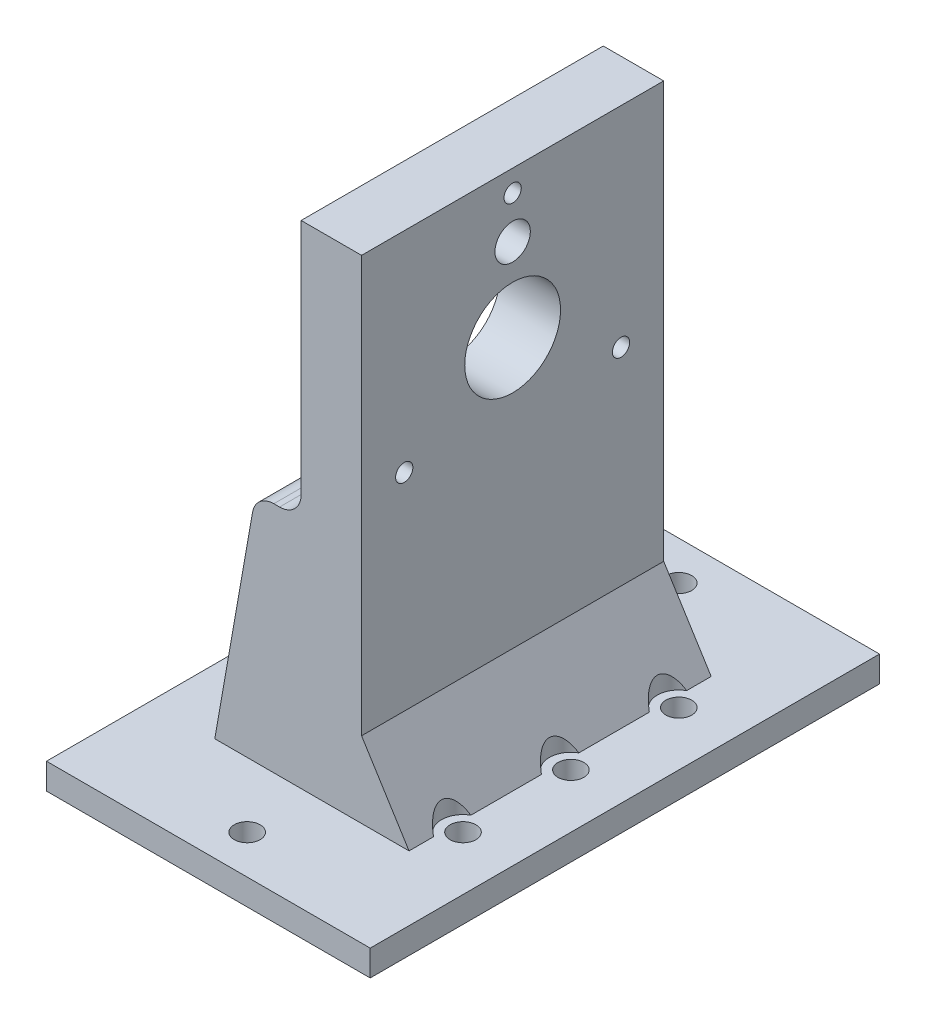
ISO-10303-21;
HEADER;
FILE_DESCRIPTION(('STEP AP214'),'2;1');
FILE_NAME('part.step','',(''),(''),'','','');
FILE_SCHEMA(('AUTOMOTIVE_DESIGN { 1 0 10303 214 1 1 1 1 }'));
ENDSEC;
DATA;
#1=APPLICATION_CONTEXT('core data for automotive mechanical design processes');
#2=APPLICATION_PROTOCOL_DEFINITION('international standard','automotive_design',2000,#1);
#3=PRODUCT_CONTEXT('',#1,'mechanical');
#4=PRODUCT('Part','Part','',(#3));
#5=PRODUCT_RELATED_PRODUCT_CATEGORY('part','',(#4));
#6=PRODUCT_DEFINITION_FORMATION('','',#4);
#7=PRODUCT_DEFINITION_CONTEXT('part definition',#1,'design');
#8=PRODUCT_DEFINITION('design','',#6,#7);
#9=PRODUCT_DEFINITION_SHAPE('','',#8);
#10=(LENGTH_UNIT() NAMED_UNIT(*) SI_UNIT(.MILLI.,.METRE.));
#11=(NAMED_UNIT(*) PLANE_ANGLE_UNIT() SI_UNIT($,.RADIAN.));
#12=(NAMED_UNIT(*) SI_UNIT($,.STERADIAN.) SOLID_ANGLE_UNIT());
#13=UNCERTAINTY_MEASURE_WITH_UNIT(LENGTH_MEASURE(1.E-05),#10,'distance_accuracy_value','');
#14=(GEOMETRIC_REPRESENTATION_CONTEXT(3) GLOBAL_UNCERTAINTY_ASSIGNED_CONTEXT((#13)) GLOBAL_UNIT_ASSIGNED_CONTEXT((#10,
#11,#12)) REPRESENTATION_CONTEXT('',''));
#15=CARTESIAN_POINT('',(0.,0.,0.));
#16=DIRECTION('',(0.,0.,1.));
#17=DIRECTION('',(1.,0.,0.));
#18=AXIS2_PLACEMENT_3D('',#15,#16,#17);
#19=CARTESIAN_POINT('',(0.,6.,0.));
#20=DIRECTION('',(0.,0.,-1.));
#21=DIRECTION('',(-1.,0.,0.));
#22=AXIS2_PLACEMENT_3D('',#19,#20,#21);
#23=PLANE('',#22);
#24=DIRECTION('',(-0.172799478008125,-0.984957024646314,0.));
#25=VECTOR('',#24,1.);
#26=CARTESIAN_POINT('',(35.,120.,0.));
#27=LINE('',#26,#25);
#28=CARTESIAN_POINT('',(23.748069717551,55.8639973900406,0.));
#29=VERTEX_POINT('',#28);
#30=CARTESIAN_POINT('',(15.,6.,0.));
#31=VERTEX_POINT('',#30);
#32=EDGE_CURVE('E378',#29,#31,#27,.T.);
#33=ORIENTED_EDGE('',*,*,#32,.F.);
#34=CARTESIAN_POINT('',(28.6728548407826,55.,0.));
#35=DIRECTION('',(0.,0.,-1.));
#36=DIRECTION('',(-1.,0.,0.));
#37=AXIS2_PLACEMENT_3D('',#34,#35,#36);
#38=CIRCLE('',#37,5.);
#39=CARTESIAN_POINT('',(28.6728548407826,60.,0.));
#40=VERTEX_POINT('',#39);
#41=EDGE_CURVE('E250',#29,#40,#38,.T.);
#42=ORIENTED_EDGE('',*,*,#41,.T.);
#43=DIRECTION('',(1.,0.,0.));
#44=VECTOR('',#43,1.);
#45=CARTESIAN_POINT('',(-21.4658933499122,60.,0.));
#46=LINE('',#45,#44);
#47=CARTESIAN_POINT('',(30.,60.,0.));
#48=VERTEX_POINT('',#47);
#49=EDGE_CURVE('E264',#40,#48,#46,.T.);
#50=ORIENTED_EDGE('',*,*,#49,.T.);
#51=CARTESIAN_POINT('',(30.,65.,0.));
#52=DIRECTION('',(0.,0.,-1.));
#53=DIRECTION('',(-1.,0.,0.));
#54=AXIS2_PLACEMENT_3D('',#51,#52,#53);
#55=CIRCLE('',#54,5.);
#56=CARTESIAN_POINT('',(35.,65.,0.));
#57=VERTEX_POINT('',#56);
#58=EDGE_CURVE('E11',#48,#57,#55,.F.);
#59=ORIENTED_EDGE('',*,*,#58,.T.);
#60=DIRECTION('',(0.,1.,0.));
#61=VECTOR('',#60,1.);
#62=CARTESIAN_POINT('',(35.,60.,0.));
#63=LINE('',#62,#61);
#64=CARTESIAN_POINT('',(35.,120.,0.));
#65=VERTEX_POINT('',#64);
#66=EDGE_CURVE('E172',#57,#65,#63,.T.);
#67=ORIENTED_EDGE('',*,*,#66,.T.);
#68=DIRECTION('',(1.,0.,0.));
#69=VECTOR('',#68,1.);
#70=CARTESIAN_POINT('',(0.,120.,0.));
#71=LINE('',#70,#69);
#72=CARTESIAN_POINT('',(49.,120.,0.));
#73=VERTEX_POINT('',#72);
#74=EDGE_CURVE('E177',#65,#73,#71,.T.);
#75=ORIENTED_EDGE('',*,*,#74,.T.);
#76=DIRECTION('',(0.,-1.,0.));
#77=VECTOR('',#76,1.);
#78=CARTESIAN_POINT('',(49.,120.,0.));
#79=LINE('',#78,#77);
#80=CARTESIAN_POINT('',(49.,23.6,0.));
#81=VERTEX_POINT('',#80);
#82=EDGE_CURVE('E206',#73,#81,#79,.T.);
#83=ORIENTED_EDGE('',*,*,#82,.T.);
#84=DIRECTION('',(-0.52999894000318,0.847998304005088,0.));
#85=VECTOR('',#84,1.);
#86=CARTESIAN_POINT('',(60.,6.,0.));
#87=LINE('',#86,#85);
#88=CARTESIAN_POINT('',(60.,6.,0.));
#89=VERTEX_POINT('',#88);
#90=EDGE_CURVE('E389',#89,#81,#87,.T.);
#91=ORIENTED_EDGE('',*,*,#90,.F.);
#92=DIRECTION('',(-1.,0.,0.));
#93=VECTOR('',#92,1.);
#94=CARTESIAN_POINT('',(75.,6.,0.));
#95=LINE('',#94,#93);
#96=EDGE_CURVE('E251',#89,#31,#95,.T.);
#97=ORIENTED_EDGE('',*,*,#96,.T.);
#98=EDGE_LOOP('',(#33,#42,#50,#59,#67,#75,#83,#91,#97));
#99=FACE_BOUND('',#98,.T.);
#100=ADVANCED_FACE('F40',(#99),#23,.T.);
#101=CARTESIAN_POINT('',(0.,6.,70.));
#102=DIRECTION('',(0.,0.,1.));
#103=DIRECTION('',(1.,0.,0.));
#104=AXIS2_PLACEMENT_3D('',#101,#102,#103);
#105=PLANE('',#104);
#106=DIRECTION('',(-1.,0.,0.));
#107=VECTOR('',#106,1.);
#108=CARTESIAN_POINT('',(35.,60.,70.));
#109=LINE('',#108,#107);
#110=CARTESIAN_POINT('',(30.,60.,70.));
#111=VERTEX_POINT('',#110);
#112=CARTESIAN_POINT('',(28.6728548407826,60.,70.));
#113=VERTEX_POINT('',#112);
#114=EDGE_CURVE('E261',#111,#113,#109,.T.);
#115=ORIENTED_EDGE('',*,*,#114,.T.);
#116=CARTESIAN_POINT('',(28.6728548407826,55.,70.));
#117=DIRECTION('',(0.,0.,1.));
#118=DIRECTION('',(1.,0.,0.));
#119=AXIS2_PLACEMENT_3D('',#116,#117,#118);
#120=CIRCLE('',#119,5.);
#121=CARTESIAN_POINT('',(23.748069717551,55.8639973900406,70.));
#122=VERTEX_POINT('',#121);
#123=EDGE_CURVE('E256',#113,#122,#120,.T.);
#124=ORIENTED_EDGE('',*,*,#123,.T.);
#125=DIRECTION('',(-0.172799478008125,-0.984957024646314,0.));
#126=VECTOR('',#125,1.);
#127=CARTESIAN_POINT('',(35.,120.,70.));
#128=LINE('',#127,#126);
#129=CARTESIAN_POINT('',(15.,6.,70.));
#130=VERTEX_POINT('',#129);
#131=EDGE_CURVE('E379',#122,#130,#128,.T.);
#132=ORIENTED_EDGE('',*,*,#131,.T.);
#133=DIRECTION('',(-1.,0.,0.));
#134=VECTOR('',#133,1.);
#135=CARTESIAN_POINT('',(75.,6.,70.));
#136=LINE('',#135,#134);
#137=CARTESIAN_POINT('',(60.,6.,70.));
#138=VERTEX_POINT('',#137);
#139=EDGE_CURVE('E226',#138,#130,#136,.T.);
#140=ORIENTED_EDGE('',*,*,#139,.F.);
#141=DIRECTION('',(-0.52999894000318,0.847998304005088,0.));
#142=VECTOR('',#141,1.);
#143=CARTESIAN_POINT('',(60.,6.,70.));
#144=LINE('',#143,#142);
#145=CARTESIAN_POINT('',(49.,23.6,70.));
#146=VERTEX_POINT('',#145);
#147=EDGE_CURVE('E386',#138,#146,#144,.T.);
#148=ORIENTED_EDGE('',*,*,#147,.T.);
#149=DIRECTION('',(0.,-1.,0.));
#150=VECTOR('',#149,1.);
#151=CARTESIAN_POINT('',(49.,120.,70.));
#152=LINE('',#151,#150);
#153=CARTESIAN_POINT('',(49.,120.,70.));
#154=VERTEX_POINT('',#153);
#155=EDGE_CURVE('E208',#154,#146,#152,.T.);
#156=ORIENTED_EDGE('',*,*,#155,.F.);
#157=DIRECTION('',(-1.,0.,0.));
#158=VECTOR('',#157,1.);
#159=CARTESIAN_POINT('',(0.,120.,70.));
#160=LINE('',#159,#158);
#161=CARTESIAN_POINT('',(35.,120.,70.));
#162=VERTEX_POINT('',#161);
#163=EDGE_CURVE('E193',#154,#162,#160,.T.);
#164=ORIENTED_EDGE('',*,*,#163,.T.);
#165=DIRECTION('',(0.,1.,0.));
#166=VECTOR('',#165,1.);
#167=CARTESIAN_POINT('',(35.,60.,70.));
#168=LINE('',#167,#166);
#169=CARTESIAN_POINT('',(35.,65.,70.));
#170=VERTEX_POINT('',#169);
#171=EDGE_CURVE('E183',#170,#162,#168,.T.);
#172=ORIENTED_EDGE('',*,*,#171,.F.);
#173=CARTESIAN_POINT('',(30.,65.,70.));
#174=DIRECTION('',(0.,0.,1.));
#175=DIRECTION('',(1.,0.,0.));
#176=AXIS2_PLACEMENT_3D('',#173,#174,#175);
#177=CIRCLE('',#176,5.);
#178=EDGE_CURVE('E48',#170,#111,#177,.F.);
#179=ORIENTED_EDGE('',*,*,#178,.T.);
#180=EDGE_LOOP('',(#115,#124,#132,#140,#148,#156,#164,#172,#179));
#181=FACE_BOUND('',#180,.T.);
#182=ADVANCED_FACE('F260',(#181),#105,.T.);
#183=CARTESIAN_POINT('',(75.,86.,35.));
#184=DIRECTION('',(-1.,0.,0.));
#185=DIRECTION('',(0.,0.,1.));
#186=AXIS2_PLACEMENT_3D('',#183,#184,#185);
#187=CYLINDRICAL_SURFACE('',#186,11.1);
#188=CARTESIAN_POINT('',(49.,86.,35.));
#189=DIRECTION('',(1.,0.,0.));
#190=DIRECTION('',(0.,0.,-1.));
#191=AXIS2_PLACEMENT_3D('',#188,#189,#190);
#192=CIRCLE('',#191,11.1);
#193=CARTESIAN_POINT('',(49.,86.,23.9));
#194=VERTEX_POINT('',#193);
#195=EDGE_CURVE('E227',#194,#194,#192,.T.);
#196=ORIENTED_EDGE('',*,*,#195,.T.);
#197=EDGE_LOOP('',(#196));
#198=FACE_BOUND('',#197,.T.);
#199=CARTESIAN_POINT('',(35.,86.,35.));
#200=DIRECTION('',(-1.,0.,0.));
#201=DIRECTION('',(0.,0.,1.));
#202=AXIS2_PLACEMENT_3D('',#199,#200,#201);
#203=CIRCLE('',#202,11.1);
#204=CARTESIAN_POINT('',(35.,86.,46.1));
#205=VERTEX_POINT('',#204);
#206=EDGE_CURVE('E883',#205,#205,#203,.F.);
#207=ORIENTED_EDGE('',*,*,#206,.F.);
#208=EDGE_LOOP('',(#207));
#209=FACE_BOUND('',#208,.T.);
#210=ADVANCED_FACE('F277',(#198,#209),#187,.F.);
#211=CARTESIAN_POINT('',(75.,71.5000000000006,60.1147367097499));
#212=DIRECTION('',(-1.,0.,0.));
#213=DIRECTION('',(0.,0.,1.));
#214=AXIS2_PLACEMENT_3D('',#211,#212,#213);
#215=CYLINDRICAL_SURFACE('',#214,2.);
#216=CARTESIAN_POINT('',(49.,71.5000000000006,60.1147367097499));
#217=DIRECTION('',(1.,0.,0.));
#218=DIRECTION('',(0.,0.,-1.));
#219=AXIS2_PLACEMENT_3D('',#216,#217,#218);
#220=CIRCLE('',#219,2.);
#221=CARTESIAN_POINT('',(49.,71.5000000000006,58.1147367097499));
#222=VERTEX_POINT('',#221);
#223=EDGE_CURVE('E230',#222,#222,#220,.T.);
#224=ORIENTED_EDGE('',*,*,#223,.T.);
#225=EDGE_LOOP('',(#224));
#226=FACE_BOUND('',#225,.T.);
#227=CARTESIAN_POINT('',(35.,71.5000000000006,60.1147367097499));
#228=DIRECTION('',(-1.,0.,0.));
#229=DIRECTION('',(0.,0.,1.));
#230=AXIS2_PLACEMENT_3D('',#227,#228,#229);
#231=CIRCLE('',#230,2.);
#232=CARTESIAN_POINT('',(35.,71.5000000000006,62.1147367097499));
#233=VERTEX_POINT('',#232);
#234=EDGE_CURVE('E885',#233,#233,#231,.F.);
#235=ORIENTED_EDGE('',*,*,#234,.F.);
#236=EDGE_LOOP('',(#235));
#237=FACE_BOUND('',#236,.T.);
#238=ADVANCED_FACE('F543',(#226,#237),#215,.F.);
#239=CARTESIAN_POINT('',(75.,71.4999999999995,9.88526329025236));
#240=DIRECTION('',(-1.,0.,0.));
#241=DIRECTION('',(0.,0.,1.));
#242=AXIS2_PLACEMENT_3D('',#239,#240,#241);
#243=CYLINDRICAL_SURFACE('',#242,2.00000000000001);
#244=CARTESIAN_POINT('',(49.,71.4999999999995,9.88526329025236));
#245=DIRECTION('',(1.,0.,0.));
#246=DIRECTION('',(0.,0.,-1.));
#247=AXIS2_PLACEMENT_3D('',#244,#245,#246);
#248=CIRCLE('',#247,2.00000000000001);
#249=CARTESIAN_POINT('',(49.,71.4999999999995,7.88526329025236));
#250=VERTEX_POINT('',#249);
#251=EDGE_CURVE('E234',#250,#250,#248,.T.);
#252=ORIENTED_EDGE('',*,*,#251,.T.);
#253=EDGE_LOOP('',(#252));
#254=FACE_BOUND('',#253,.T.);
#255=CARTESIAN_POINT('',(35.,71.4999999999995,9.88526329025237));
#256=DIRECTION('',(-1.,0.,0.));
#257=DIRECTION('',(0.,0.,1.));
#258=AXIS2_PLACEMENT_3D('',#255,#256,#257);
#259=CIRCLE('',#258,2.00000000000001);
#260=CARTESIAN_POINT('',(35.,71.4999999999995,11.8852632902524));
#261=VERTEX_POINT('',#260);
#262=EDGE_CURVE('E890',#261,#261,#259,.F.);
#263=ORIENTED_EDGE('',*,*,#262,.F.);
#264=EDGE_LOOP('',(#263));
#265=FACE_BOUND('',#264,.T.);
#266=ADVANCED_FACE('F540',(#254,#265),#243,.F.);
#267=CARTESIAN_POINT('',(75.,105.25,35.));
#268=DIRECTION('',(-1.,0.,0.));
#269=DIRECTION('',(0.,0.,1.));
#270=AXIS2_PLACEMENT_3D('',#267,#268,#269);
#271=CYLINDRICAL_SURFACE('',#270,4.1);
#272=CARTESIAN_POINT('',(49.,105.25,35.));
#273=DIRECTION('',(1.,0.,0.));
#274=DIRECTION('',(0.,0.,-1.));
#275=AXIS2_PLACEMENT_3D('',#272,#273,#274);
#276=CIRCLE('',#275,4.1);
#277=CARTESIAN_POINT('',(49.,105.25,30.9));
#278=VERTEX_POINT('',#277);
#279=EDGE_CURVE('E237',#278,#278,#276,.T.);
#280=ORIENTED_EDGE('',*,*,#279,.T.);
#281=EDGE_LOOP('',(#280));
#282=FACE_BOUND('',#281,.T.);
#283=CARTESIAN_POINT('',(35.,105.25,35.));
#284=DIRECTION('',(-1.,0.,0.));
#285=DIRECTION('',(0.,0.,1.));
#286=AXIS2_PLACEMENT_3D('',#283,#284,#285);
#287=CIRCLE('',#286,4.1);
#288=CARTESIAN_POINT('',(35.,105.25,39.1));
#289=VERTEX_POINT('',#288);
#290=EDGE_CURVE('E246',#289,#289,#287,.F.);
#291=ORIENTED_EDGE('',*,*,#290,.F.);
#292=EDGE_LOOP('',(#291));
#293=FACE_BOUND('',#292,.T.);
#294=ADVANCED_FACE('F538',(#282,#293),#271,.F.);
#295=CARTESIAN_POINT('',(75.,115.,35.));
#296=DIRECTION('',(-1.,0.,0.));
#297=DIRECTION('',(0.,0.,1.));
#298=AXIS2_PLACEMENT_3D('',#295,#296,#297);
#299=CYLINDRICAL_SURFACE('',#298,2.);
#300=CARTESIAN_POINT('',(49.,115.,35.));
#301=DIRECTION('',(1.,0.,0.));
#302=DIRECTION('',(0.,0.,-1.));
#303=AXIS2_PLACEMENT_3D('',#300,#301,#302);
#304=CIRCLE('',#303,2.);
#305=CARTESIAN_POINT('',(49.,115.,33.));
#306=VERTEX_POINT('',#305);
#307=EDGE_CURVE('E240',#306,#306,#304,.T.);
#308=ORIENTED_EDGE('',*,*,#307,.T.);
#309=EDGE_LOOP('',(#308));
#310=FACE_BOUND('',#309,.T.);
#311=CARTESIAN_POINT('',(35.,115.,35.));
#312=DIRECTION('',(-1.,0.,0.));
#313=DIRECTION('',(0.,0.,1.));
#314=AXIS2_PLACEMENT_3D('',#311,#312,#313);
#315=CIRCLE('',#314,2.);
#316=CARTESIAN_POINT('',(35.,115.,37.));
#317=VERTEX_POINT('',#316);
#318=EDGE_CURVE('E182',#317,#317,#315,.F.);
#319=ORIENTED_EDGE('',*,*,#318,.F.);
#320=EDGE_LOOP('',(#319));
#321=FACE_BOUND('',#320,.T.);
#322=ADVANCED_FACE('F486',(#310,#321),#299,.F.);
#323=CARTESIAN_POINT('',(60.,6.,70.));
#324=DIRECTION('',(-0.847998304005088,-0.52999894000318,0.));
#325=DIRECTION('',(0.52999894000318,-0.847998304005088,0.));
#326=AXIS2_PLACEMENT_3D('',#323,#324,#325);
#327=PLANE('',#326);
#328=CARTESIAN_POINT('',(62.5000000000008,1.99999999999871,59.9999999999998));
#329=DIRECTION('',(-0.847998304005088,-0.52999894000318,0.));
#330=DIRECTION('',(0.52999894000318,-0.847998304005088,0.));
#331=AXIS2_PLACEMENT_3D('',#328,#329,#330);
#332=ELLIPSE('',#331,9.43398113205662,5.);
#333=CARTESIAN_POINT('',(60.,6.,55.6698729810781));
#334=VERTEX_POINT('',#333);
#335=CARTESIAN_POINT('',(60.,6.,64.3301270189216));
#336=VERTEX_POINT('',#335);
#337=EDGE_CURVE('E224',#334,#336,#332,.F.);
#338=ORIENTED_EDGE('',*,*,#337,.F.);
#339=DIRECTION('',(0.,0.,-1.));
#340=VECTOR('',#339,1.);
#341=CARTESIAN_POINT('',(60.,6.,70.));
#342=LINE('',#341,#340);
#343=CARTESIAN_POINT('',(60.,6.,39.3301270189217));
#344=VERTEX_POINT('',#343);
#345=EDGE_CURVE('E387',#334,#344,#342,.T.);
#346=ORIENTED_EDGE('',*,*,#345,.T.);
#347=CARTESIAN_POINT('',(62.5000000000005,1.99999999999914,34.9999999999998));
#348=DIRECTION('',(-0.847998304005088,-0.52999894000318,0.));
#349=DIRECTION('',(0.52999894000318,-0.847998304005088,0.));
#350=AXIS2_PLACEMENT_3D('',#347,#348,#349);
#351=ELLIPSE('',#350,9.43398113205659,4.99999999999999);
#352=CARTESIAN_POINT('',(60.,6.,30.669872981078));
#353=VERTEX_POINT('',#352);
#354=EDGE_CURVE('E222',#353,#344,#351,.F.);
#355=ORIENTED_EDGE('',*,*,#354,.F.);
#356=CARTESIAN_POINT('',(60.,6.,14.3301270189219));
#357=VERTEX_POINT('',#356);
#358=EDGE_CURVE('E388',#353,#357,#342,.T.);
#359=ORIENTED_EDGE('',*,*,#358,.T.);
#360=CARTESIAN_POINT('',(62.5000000000003,1.99999999999956,9.99999999999983));
#361=DIRECTION('',(-0.847998304005088,-0.52999894000318,0.));
#362=DIRECTION('',(0.52999894000318,-0.847998304005088,0.));
#363=AXIS2_PLACEMENT_3D('',#360,#361,#362);
#364=ELLIPSE('',#363,9.43398113205662,5.);
#365=CARTESIAN_POINT('',(60.,6.,5.66987298107779));
#366=VERTEX_POINT('',#365);
#367=EDGE_CURVE('E220',#366,#357,#364,.F.);
#368=ORIENTED_EDGE('',*,*,#367,.F.);
#369=EDGE_CURVE('E381',#366,#89,#342,.T.);
#370=ORIENTED_EDGE('',*,*,#369,.T.);
#371=ORIENTED_EDGE('',*,*,#90,.T.);
#372=DIRECTION('',(0.,0.,-1.));
#373=VECTOR('',#372,1.);
#374=CARTESIAN_POINT('',(49.,23.6,0.));
#375=LINE('',#374,#373);
#376=EDGE_CURVE('E392',#146,#81,#375,.T.);
#377=ORIENTED_EDGE('',*,*,#376,.F.);
#378=ORIENTED_EDGE('',*,*,#147,.F.);
#379=EDGE_CURVE('E383',#138,#336,#342,.T.);
#380=ORIENTED_EDGE('',*,*,#379,.T.);
#381=EDGE_LOOP('',(#338,#346,#355,#359,#368,#370,#371,#377,#378,#380));
#382=FACE_BOUND('',#381,.T.);
#383=ADVANCED_FACE('F483',(#382),#327,.F.);
#384=CARTESIAN_POINT('',(35.,120.,70.));
#385=DIRECTION('',(0.984957024646314,-0.172799478008125,0.));
#386=DIRECTION('',(0.172799478008125,0.984957024646314,0.));
#387=AXIS2_PLACEMENT_3D('',#384,#385,#386);
#388=PLANE('',#387);
#389=ORIENTED_EDGE('',*,*,#131,.F.);
#390=DIRECTION('',(0.,0.,-1.));
#391=VECTOR('',#390,1.);
#392=CARTESIAN_POINT('',(23.748069717551,55.8639973900406,70.));
#393=LINE('',#392,#391);
#394=EDGE_CURVE('E247',#122,#29,#393,.T.);
#395=ORIENTED_EDGE('',*,*,#394,.T.);
#396=ORIENTED_EDGE('',*,*,#32,.T.);
#397=DIRECTION('',(0.,0.,-1.));
#398=VECTOR('',#397,1.);
#399=CARTESIAN_POINT('',(15.,6.,70.));
#400=LINE('',#399,#398);
#401=CARTESIAN_POINT('',(15.,6.,5.6698729810775));
#402=VERTEX_POINT('',#401);
#403=EDGE_CURVE('E396',#402,#31,#400,.T.);
#404=ORIENTED_EDGE('',*,*,#403,.F.);
#405=CARTESIAN_POINT('',(12.5000000000003,-8.24999999999862,9.99999999999983));
#406=DIRECTION('',(0.984957024646314,-0.172799478008125,0.));
#407=DIRECTION('',(-0.172799478008125,-0.984957024646314,0.));
#408=AXIS2_PLACEMENT_3D('',#405,#406,#407);
#409=ELLIPSE('',#408,28.9352725924606,5.);
#410=CARTESIAN_POINT('',(15.,6.,14.3301270189222));
#411=VERTEX_POINT('',#410);
#412=EDGE_CURVE('E213',#411,#402,#409,.F.);
#413=ORIENTED_EDGE('',*,*,#412,.F.);
#414=CARTESIAN_POINT('',(15.,6.,30.6698729810774));
#415=VERTEX_POINT('',#414);
#416=EDGE_CURVE('E400',#415,#411,#400,.T.);
#417=ORIENTED_EDGE('',*,*,#416,.F.);
#418=CARTESIAN_POINT('',(12.5000000000005,-8.24999999999712,34.9999999999998));
#419=DIRECTION('',(0.984957024646314,-0.172799478008125,0.));
#420=DIRECTION('',(-0.172799478008125,-0.984957024646314,0.));
#421=AXIS2_PLACEMENT_3D('',#418,#419,#420);
#422=ELLIPSE('',#421,28.9352725924606,5.);
#423=CARTESIAN_POINT('',(15.,6.,39.3301270189223));
#424=VERTEX_POINT('',#423);
#425=EDGE_CURVE('E218',#424,#415,#422,.F.);
#426=ORIENTED_EDGE('',*,*,#425,.F.);
#427=CARTESIAN_POINT('',(15.,6.,55.6698729810772));
#428=VERTEX_POINT('',#427);
#429=EDGE_CURVE('E399',#428,#424,#400,.T.);
#430=ORIENTED_EDGE('',*,*,#429,.F.);
#431=CARTESIAN_POINT('',(12.5000000000008,-8.24999999999565,59.9999999999998));
#432=DIRECTION('',(0.984957024646314,-0.172799478008125,0.));
#433=DIRECTION('',(-0.172799478008125,-0.984957024646314,0.));
#434=AXIS2_PLACEMENT_3D('',#431,#432,#433);
#435=ELLIPSE('',#434,28.9352725924606,5.);
#436=CARTESIAN_POINT('',(15.,6.,64.3301270189225));
#437=VERTEX_POINT('',#436);
#438=EDGE_CURVE('E216',#437,#428,#435,.F.);
#439=ORIENTED_EDGE('',*,*,#438,.F.);
#440=EDGE_CURVE('E397',#130,#437,#400,.T.);
#441=ORIENTED_EDGE('',*,*,#440,.F.);
#442=EDGE_LOOP('',(#389,#395,#396,#404,#413,#417,#426,#430,#439,#441));
#443=FACE_BOUND('',#442,.T.);
#444=ADVANCED_FACE('F479',(#443),#388,.F.);
#445=CARTESIAN_POINT('',(12.5,120.,34.999999999999));
#446=DIRECTION('',(0.,-1.,0.));
#447=DIRECTION('',(0.,0.,-1.));
#448=AXIS2_PLACEMENT_3D('',#445,#446,#447);
#449=CYLINDRICAL_SURFACE('',#448,3.);
#450=CARTESIAN_POINT('',(12.5,0.,34.999999999999));
#451=DIRECTION('',(0.,-1.,0.));
#452=DIRECTION('',(0.,0.,-1.));
#453=AXIS2_PLACEMENT_3D('',#450,#451,#452);
#454=CIRCLE('',#453,3.);
#455=CARTESIAN_POINT('',(12.5,0.,31.999999999999));
#456=VERTEX_POINT('',#455);
#457=EDGE_CURVE('E349',#456,#456,#454,.T.);
#458=ORIENTED_EDGE('',*,*,#457,.T.);
#459=EDGE_LOOP('',(#458));
#460=FACE_BOUND('',#459,.T.);
#461=CARTESIAN_POINT('',(12.5,6.00000000000001,34.999999999999));
#462=DIRECTION('',(0.,1.,0.));
#463=DIRECTION('',(0.,0.,1.));
#464=AXIS2_PLACEMENT_3D('',#461,#462,#463);
#465=CIRCLE('',#464,3.);
#466=CARTESIAN_POINT('',(12.5,6.00000000000001,37.999999999999));
#467=VERTEX_POINT('',#466);
#468=EDGE_CURVE('E360',#467,#467,#465,.T.);
#469=ORIENTED_EDGE('',*,*,#468,.T.);
#470=EDGE_LOOP('',(#469));
#471=FACE_BOUND('',#470,.T.);
#472=ADVANCED_FACE('F472',(#460,#471),#449,.F.);
#473=CARTESIAN_POINT('',(12.5000000000003,120.,9.99999999999983));
#474=DIRECTION('',(0.,-1.,0.));
#475=DIRECTION('',(0.,0.,-1.));
#476=AXIS2_PLACEMENT_3D('',#473,#474,#475);
#477=CYLINDRICAL_SURFACE('',#476,3.);
#478=CARTESIAN_POINT('',(12.5000000000003,0.,9.99999999999983));
#479=DIRECTION('',(0.,-1.,0.));
#480=DIRECTION('',(0.,0.,-1.));
#481=AXIS2_PLACEMENT_3D('',#478,#479,#480);
#482=CIRCLE('',#481,3.);
#483=CARTESIAN_POINT('',(12.5000000000003,0.,6.99999999999983));
#484=VERTEX_POINT('',#483);
#485=EDGE_CURVE('E350',#484,#484,#482,.T.);
#486=ORIENTED_EDGE('',*,*,#485,.T.);
#487=EDGE_LOOP('',(#486));
#488=FACE_BOUND('',#487,.T.);
#489=CARTESIAN_POINT('',(12.5000000000003,6.00000000000001,9.99999999999983));
#490=DIRECTION('',(0.,1.,0.));
#491=DIRECTION('',(0.,0.,1.));
#492=AXIS2_PLACEMENT_3D('',#489,#490,#491);
#493=CIRCLE('',#492,3.);
#494=CARTESIAN_POINT('',(12.5000000000003,6.00000000000001,12.9999999999998));
#495=VERTEX_POINT('',#494);
#496=EDGE_CURVE('E363',#495,#495,#493,.T.);
#497=ORIENTED_EDGE('',*,*,#496,.T.);
#498=EDGE_LOOP('',(#497));
#499=FACE_BOUND('',#498,.T.);
#500=ADVANCED_FACE('F463',(#488,#499),#477,.F.);
#501=CARTESIAN_POINT('',(12.4999999999999,120.,59.999999999999));
#502=DIRECTION('',(0.,-1.,0.));
#503=DIRECTION('',(0.,0.,-1.));
#504=AXIS2_PLACEMENT_3D('',#501,#502,#503);
#505=CYLINDRICAL_SURFACE('',#504,3.);
#506=CARTESIAN_POINT('',(12.4999999999999,0.,59.999999999999));
#507=DIRECTION('',(0.,-1.,0.));
#508=DIRECTION('',(0.,0.,-1.));
#509=AXIS2_PLACEMENT_3D('',#506,#507,#508);
#510=CIRCLE('',#509,3.);
#511=CARTESIAN_POINT('',(12.4999999999999,0.,56.999999999999));
#512=VERTEX_POINT('',#511);
#513=EDGE_CURVE('E346',#512,#512,#510,.T.);
#514=ORIENTED_EDGE('',*,*,#513,.T.);
#515=EDGE_LOOP('',(#514));
#516=FACE_BOUND('',#515,.T.);
#517=CARTESIAN_POINT('',(12.4999999999999,6.00000000000001,59.999999999999));
#518=DIRECTION('',(0.,1.,0.));
#519=DIRECTION('',(0.,0.,1.));
#520=AXIS2_PLACEMENT_3D('',#517,#518,#519);
#521=CIRCLE('',#520,3.);
#522=CARTESIAN_POINT('',(12.4999999999999,6.00000000000001,62.999999999999));
#523=VERTEX_POINT('',#522);
#524=EDGE_CURVE('E366',#523,#523,#521,.T.);
#525=ORIENTED_EDGE('',*,*,#524,.T.);
#526=EDGE_LOOP('',(#525));
#527=FACE_BOUND('',#526,.T.);
#528=ADVANCED_FACE('F454',(#516,#527),#505,.F.);
#529=CARTESIAN_POINT('',(62.4999999999999,120.,60.));
#530=DIRECTION('',(0.,-1.,0.));
#531=DIRECTION('',(0.,0.,-1.));
#532=AXIS2_PLACEMENT_3D('',#529,#530,#531);
#533=CYLINDRICAL_SURFACE('',#532,3.00000000000001);
#534=CARTESIAN_POINT('',(62.4999999999999,0.,60.));
#535=DIRECTION('',(0.,-1.,0.));
#536=DIRECTION('',(0.,0.,-1.));
#537=AXIS2_PLACEMENT_3D('',#534,#535,#536);
#538=CIRCLE('',#537,3.00000000000001);
#539=CARTESIAN_POINT('',(62.4999999999999,0.,57.));
#540=VERTEX_POINT('',#539);
#541=EDGE_CURVE('E342',#540,#540,#538,.T.);
#542=ORIENTED_EDGE('',*,*,#541,.T.);
#543=EDGE_LOOP('',(#542));
#544=FACE_BOUND('',#543,.T.);
#545=CARTESIAN_POINT('',(62.4999999999999,6.00000000000001,60.));
#546=DIRECTION('',(0.,1.,0.));
#547=DIRECTION('',(0.,0.,1.));
#548=AXIS2_PLACEMENT_3D('',#545,#546,#547);
#549=CIRCLE('',#548,3.00000000000001);
#550=CARTESIAN_POINT('',(62.4999999999999,6.00000000000001,63.));
#551=VERTEX_POINT('',#550);
#552=EDGE_CURVE('E369',#551,#551,#549,.T.);
#553=ORIENTED_EDGE('',*,*,#552,.T.);
#554=EDGE_LOOP('',(#553));
#555=FACE_BOUND('',#554,.T.);
#556=ADVANCED_FACE('F451',(#544,#555),#533,.F.);
#557=CARTESIAN_POINT('',(62.5,120.,35.));
#558=DIRECTION('',(0.,-1.,0.));
#559=DIRECTION('',(0.,0.,-1.));
#560=AXIS2_PLACEMENT_3D('',#557,#558,#559);
#561=CYLINDRICAL_SURFACE('',#560,3.00000000000001);
#562=CARTESIAN_POINT('',(62.5,0.,35.));
#563=DIRECTION('',(0.,-1.,0.));
#564=DIRECTION('',(0.,0.,-1.));
#565=AXIS2_PLACEMENT_3D('',#562,#563,#564);
#566=CIRCLE('',#565,3.00000000000001);
#567=CARTESIAN_POINT('',(62.5,0.,32.));
#568=VERTEX_POINT('',#567);
#569=EDGE_CURVE('E345',#568,#568,#566,.T.);
#570=ORIENTED_EDGE('',*,*,#569,.T.);
#571=EDGE_LOOP('',(#570));
#572=FACE_BOUND('',#571,.T.);
#573=CARTESIAN_POINT('',(62.5,6.00000000000001,35.));
#574=DIRECTION('',(0.,1.,0.));
#575=DIRECTION('',(0.,0.,1.));
#576=AXIS2_PLACEMENT_3D('',#573,#574,#575);
#577=CIRCLE('',#576,3.00000000000001);
#578=CARTESIAN_POINT('',(62.5,6.00000000000001,38.));
#579=VERTEX_POINT('',#578);
#580=EDGE_CURVE('E372',#579,#579,#577,.T.);
#581=ORIENTED_EDGE('',*,*,#580,.T.);
#582=EDGE_LOOP('',(#581));
#583=FACE_BOUND('',#582,.T.);
#584=ADVANCED_FACE('F453',(#572,#583),#561,.F.);
#585=CARTESIAN_POINT('',(62.5000000000003,120.,10.0000000000009));
#586=DIRECTION('',(0.,-1.,0.));
#587=DIRECTION('',(0.,0.,-1.));
#588=AXIS2_PLACEMENT_3D('',#585,#586,#587);
#589=CYLINDRICAL_SURFACE('',#588,3.00000000000001);
#590=CARTESIAN_POINT('',(62.5000000000003,0.,10.0000000000009));
#591=DIRECTION('',(0.,-1.,0.));
#592=DIRECTION('',(0.,0.,-1.));
#593=AXIS2_PLACEMENT_3D('',#590,#591,#592);
#594=CIRCLE('',#593,3.00000000000001);
#595=CARTESIAN_POINT('',(62.5000000000003,0.,7.00000000000087));
#596=VERTEX_POINT('',#595);
#597=EDGE_CURVE('E353',#596,#596,#594,.T.);
#598=ORIENTED_EDGE('',*,*,#597,.T.);
#599=EDGE_LOOP('',(#598));
#600=FACE_BOUND('',#599,.T.);
#601=CARTESIAN_POINT('',(62.5000000000003,6.00000000000001,10.0000000000009));
#602=DIRECTION('',(0.,1.,0.));
#603=DIRECTION('',(0.,0.,1.));
#604=AXIS2_PLACEMENT_3D('',#601,#602,#603);
#605=CIRCLE('',#604,3.00000000000001);
#606=CARTESIAN_POINT('',(62.5000000000003,6.00000000000001,13.0000000000009));
#607=VERTEX_POINT('',#606);
#608=EDGE_CURVE('E375',#607,#607,#605,.T.);
#609=ORIENTED_EDGE('',*,*,#608,.T.);
#610=EDGE_LOOP('',(#609));
#611=FACE_BOUND('',#610,.T.);
#612=ADVANCED_FACE('F293',(#600,#611),#589,.F.);
#613=CARTESIAN_POINT('',(49.,120.,0.));
#614=DIRECTION('',(1.,0.,0.));
#615=DIRECTION('',(0.,0.,-1.));
#616=AXIS2_PLACEMENT_3D('',#613,#614,#615);
#617=PLANE('',#616);
#618=ORIENTED_EDGE('',*,*,#307,.F.);
#619=EDGE_LOOP('',(#618));
#620=FACE_BOUND('',#619,.T.);
#621=ORIENTED_EDGE('',*,*,#279,.F.);
#622=EDGE_LOOP('',(#621));
#623=FACE_BOUND('',#622,.T.);
#624=ORIENTED_EDGE('',*,*,#251,.F.);
#625=EDGE_LOOP('',(#624));
#626=FACE_BOUND('',#625,.T.);
#627=ORIENTED_EDGE('',*,*,#223,.F.);
#628=EDGE_LOOP('',(#627));
#629=FACE_BOUND('',#628,.T.);
#630=ORIENTED_EDGE('',*,*,#195,.F.);
#631=EDGE_LOOP('',(#630));
#632=FACE_BOUND('',#631,.T.);
#633=ORIENTED_EDGE('',*,*,#155,.T.);
#634=ORIENTED_EDGE('',*,*,#376,.T.);
#635=ORIENTED_EDGE('',*,*,#82,.F.);
#636=DIRECTION('',(0.,0.,1.));
#637=VECTOR('',#636,1.);
#638=CARTESIAN_POINT('',(49.,120.,0.));
#639=LINE('',#638,#637);
#640=EDGE_CURVE('E197',#73,#154,#639,.T.);
#641=ORIENTED_EDGE('',*,*,#640,.T.);
#642=EDGE_LOOP('',(#633,#634,#635,#641));
#643=FACE_BOUND('',#642,.T.);
#644=ADVANCED_FACE('F286',(#620,#623,#626,#629,#632,#643),#617,.T.);
#645=CARTESIAN_POINT('',(0.,6.,0.));
#646=DIRECTION('',(-1.,0.,0.));
#647=DIRECTION('',(0.,0.,1.));
#648=AXIS2_PLACEMENT_3D('',#645,#646,#647);
#649=PLANE('',#648);
#650=DIRECTION('',(0.,0.,-1.));
#651=VECTOR('',#650,1.);
#652=CARTESIAN_POINT('',(0.,0.,0.));
#653=LINE('',#652,#651);
#654=CARTESIAN_POINT('',(0.,0.,94.));
#655=VERTEX_POINT('',#654);
#656=CARTESIAN_POINT('',(0.,0.,-24.));
#657=VERTEX_POINT('',#656);
#658=EDGE_CURVE('E210',#655,#657,#653,.T.);
#659=ORIENTED_EDGE('',*,*,#658,.F.);
#660=DIRECTION('',(0.,-1.,0.));
#661=VECTOR('',#660,1.);
#662=CARTESIAN_POINT('',(0.,6.,94.));
#663=LINE('',#662,#661);
#664=CARTESIAN_POINT('',(0.,6.,94.));
#665=VERTEX_POINT('',#664);
#666=EDGE_CURVE('E231',#665,#655,#663,.T.);
#667=ORIENTED_EDGE('',*,*,#666,.F.);
#668=DIRECTION('',(0.,0.,-1.));
#669=VECTOR('',#668,1.);
#670=CARTESIAN_POINT('',(0.,6.,0.));
#671=LINE('',#670,#669);
#672=CARTESIAN_POINT('',(0.,6.,-24.));
#673=VERTEX_POINT('',#672);
#674=EDGE_CURVE('E211',#665,#673,#671,.T.);
#675=ORIENTED_EDGE('',*,*,#674,.T.);
#676=DIRECTION('',(0.,-1.,0.));
#677=VECTOR('',#676,1.);
#678=CARTESIAN_POINT('',(0.,6.,-24.));
#679=LINE('',#678,#677);
#680=EDGE_CURVE('E301',#673,#657,#679,.T.);
#681=ORIENTED_EDGE('',*,*,#680,.T.);
#682=EDGE_LOOP('',(#659,#667,#675,#681));
#683=FACE_BOUND('',#682,.T.);
#684=ADVANCED_FACE('F283',(#683),#649,.T.);
#685=CARTESIAN_POINT('',(0.,6.,0.));
#686=DIRECTION('',(0.,1.,0.));
#687=DIRECTION('',(0.,0.,1.));
#688=AXIS2_PLACEMENT_3D('',#685,#686,#687);
#689=PLANE('',#688);
#690=CARTESIAN_POINT('',(37.5,6.,-14.999999999999));
#691=DIRECTION('',(0.,-1.,0.));
#692=DIRECTION('',(0.,0.,-1.));
#693=AXIS2_PLACEMENT_3D('',#690,#691,#692);
#694=CIRCLE('',#693,3.);
#695=CARTESIAN_POINT('',(37.5,6.,-17.999999999999));
#696=VERTEX_POINT('',#695);
#697=EDGE_CURVE('E419',#696,#696,#694,.T.);
#698=ORIENTED_EDGE('',*,*,#697,.T.);
#699=EDGE_LOOP('',(#698));
#700=FACE_BOUND('',#699,.T.);
#701=ORIENTED_EDGE('',*,*,#96,.F.);
#702=ORIENTED_EDGE('',*,*,#369,.F.);
#703=CARTESIAN_POINT('',(62.5000000000003,6.,9.99999999999983));
#704=DIRECTION('',(0.,1.,0.));
#705=DIRECTION('',(0.,0.,1.));
#706=AXIS2_PLACEMENT_3D('',#703,#704,#705);
#707=CIRCLE('',#706,5.);
#708=EDGE_CURVE('E334',#366,#357,#707,.T.);
#709=ORIENTED_EDGE('',*,*,#708,.T.);
#710=ORIENTED_EDGE('',*,*,#358,.F.);
#711=CARTESIAN_POINT('',(62.5000000000005,6.,34.9999999999998));
#712=DIRECTION('',(0.,1.,0.));
#713=DIRECTION('',(0.,0.,1.));
#714=AXIS2_PLACEMENT_3D('',#711,#712,#713);
#715=CIRCLE('',#714,4.99999999999999);
#716=EDGE_CURVE('E331',#353,#344,#715,.T.);
#717=ORIENTED_EDGE('',*,*,#716,.T.);
#718=ORIENTED_EDGE('',*,*,#345,.F.);
#719=CARTESIAN_POINT('',(62.5000000000008,6.,59.9999999999998));
#720=DIRECTION('',(0.,1.,0.));
#721=DIRECTION('',(0.,0.,1.));
#722=AXIS2_PLACEMENT_3D('',#719,#720,#721);
#723=CIRCLE('',#722,5.);
#724=EDGE_CURVE('E328',#334,#336,#723,.T.);
#725=ORIENTED_EDGE('',*,*,#724,.T.);
#726=ORIENTED_EDGE('',*,*,#379,.F.);
#727=ORIENTED_EDGE('',*,*,#139,.T.);
#728=ORIENTED_EDGE('',*,*,#440,.T.);
#729=CARTESIAN_POINT('',(12.5000000000008,6.,59.9999999999998));
#730=DIRECTION('',(0.,1.,0.));
#731=DIRECTION('',(0.,0.,1.));
#732=AXIS2_PLACEMENT_3D('',#729,#730,#731);
#733=CIRCLE('',#732,5.);
#734=EDGE_CURVE('E243',#437,#428,#733,.T.);
#735=ORIENTED_EDGE('',*,*,#734,.T.);
#736=ORIENTED_EDGE('',*,*,#429,.T.);
#737=CARTESIAN_POINT('',(12.5000000000005,6.,34.9999999999998));
#738=DIRECTION('',(0.,1.,0.));
#739=DIRECTION('',(0.,0.,1.));
#740=AXIS2_PLACEMENT_3D('',#737,#738,#739);
#741=CIRCLE('',#740,5.);
#742=EDGE_CURVE('E327',#424,#415,#741,.T.);
#743=ORIENTED_EDGE('',*,*,#742,.T.);
#744=ORIENTED_EDGE('',*,*,#416,.T.);
#745=CARTESIAN_POINT('',(12.5000000000003,6.,9.99999999999983));
#746=DIRECTION('',(0.,1.,0.));
#747=DIRECTION('',(0.,0.,1.));
#748=AXIS2_PLACEMENT_3D('',#745,#746,#747);
#749=CIRCLE('',#748,5.);
#750=EDGE_CURVE('E337',#411,#402,#749,.T.);
#751=ORIENTED_EDGE('',*,*,#750,.T.);
#752=ORIENTED_EDGE('',*,*,#403,.T.);
#753=EDGE_LOOP('',(#701,#702,#709,#710,#717,#718,#725,#726,#727,#728,#735,#736,#743,#744,#751,#752));
#754=FACE_BOUND('',#753,.T.);
#755=CARTESIAN_POINT('',(37.5,6.,84.999999999999));
#756=DIRECTION('',(0.,1.,0.));
#757=DIRECTION('',(0.,0.,1.));
#758=AXIS2_PLACEMENT_3D('',#755,#756,#757);
#759=CIRCLE('',#758,3.);
#760=CARTESIAN_POINT('',(37.5,6.,87.999999999999));
#761=VERTEX_POINT('',#760);
#762=EDGE_CURVE('E320',#761,#761,#759,.T.);
#763=ORIENTED_EDGE('',*,*,#762,.F.);
#764=EDGE_LOOP('',(#763));
#765=FACE_BOUND('',#764,.T.);
#766=DIRECTION('',(0.,0.,-1.));
#767=VECTOR('',#766,1.);
#768=CARTESIAN_POINT('',(75.,6.,0.));
#769=LINE('',#768,#767);
#770=CARTESIAN_POINT('',(75.,6.,94.));
#771=VERTEX_POINT('',#770);
#772=CARTESIAN_POINT('',(75.,6.,-24.));
#773=VERTEX_POINT('',#772);
#774=EDGE_CURVE('E198',#771,#773,#769,.T.);
#775=ORIENTED_EDGE('',*,*,#774,.T.);
#776=DIRECTION('',(1.,0.,0.));
#777=VECTOR('',#776,1.);
#778=CARTESIAN_POINT('',(0.,6.,-24.));
#779=LINE('',#778,#777);
#780=EDGE_CURVE('E421',#673,#773,#779,.T.);
#781=ORIENTED_EDGE('',*,*,#780,.F.);
#782=ORIENTED_EDGE('',*,*,#674,.F.);
#783=DIRECTION('',(1.,0.,0.));
#784=VECTOR('',#783,1.);
#785=CARTESIAN_POINT('',(0.,6.,94.));
#786=LINE('',#785,#784);
#787=EDGE_CURVE('E313',#665,#771,#786,.T.);
#788=ORIENTED_EDGE('',*,*,#787,.T.);
#789=EDGE_LOOP('',(#775,#781,#782,#788));
#790=FACE_BOUND('',#789,.T.);
#791=ORIENTED_EDGE('',*,*,#496,.F.);
#792=EDGE_LOOP('',(#791));
#793=FACE_BOUND('',#792,.T.);
#794=ORIENTED_EDGE('',*,*,#524,.F.);
#795=EDGE_LOOP('',(#794));
#796=FACE_BOUND('',#795,.T.);
#797=ORIENTED_EDGE('',*,*,#468,.F.);
#798=EDGE_LOOP('',(#797));
#799=FACE_BOUND('',#798,.T.);
#800=ORIENTED_EDGE('',*,*,#608,.F.);
#801=EDGE_LOOP('',(#800));
#802=FACE_BOUND('',#801,.T.);
#803=ORIENTED_EDGE('',*,*,#580,.F.);
#804=EDGE_LOOP('',(#803));
#805=FACE_BOUND('',#804,.T.);
#806=ORIENTED_EDGE('',*,*,#552,.F.);
#807=EDGE_LOOP('',(#806));
#808=FACE_BOUND('',#807,.T.);
#809=ADVANCED_FACE('F285',(#700,#754,#765,#790,#793,#796,#799,#802,#805,#808),#689,.T.);
#810=CARTESIAN_POINT('',(0.,0.,0.));
#811=DIRECTION('',(0.,1.,0.));
#812=DIRECTION('',(0.,0.,1.));
#813=AXIS2_PLACEMENT_3D('',#810,#811,#812);
#814=PLANE('',#813);
#815=CARTESIAN_POINT('',(37.5,0.,-14.999999999999));
#816=DIRECTION('',(0.,-1.,0.));
#817=DIRECTION('',(0.,0.,-1.));
#818=AXIS2_PLACEMENT_3D('',#815,#816,#817);
#819=CIRCLE('',#818,3.);
#820=CARTESIAN_POINT('',(37.5,0.,-17.999999999999));
#821=VERTEX_POINT('',#820);
#822=EDGE_CURVE('E426',#821,#821,#819,.T.);
#823=ORIENTED_EDGE('',*,*,#822,.F.);
#824=EDGE_LOOP('',(#823));
#825=FACE_BOUND('',#824,.T.);
#826=CARTESIAN_POINT('',(37.5,0.,84.999999999999));
#827=DIRECTION('',(0.,1.,0.));
#828=DIRECTION('',(0.,0.,1.));
#829=AXIS2_PLACEMENT_3D('',#826,#827,#828);
#830=CIRCLE('',#829,3.);
#831=CARTESIAN_POINT('',(37.5,0.,87.999999999999));
#832=VERTEX_POINT('',#831);
#833=EDGE_CURVE('E316',#832,#832,#830,.T.);
#834=ORIENTED_EDGE('',*,*,#833,.T.);
#835=EDGE_LOOP('',(#834));
#836=FACE_BOUND('',#835,.T.);
#837=ORIENTED_EDGE('',*,*,#513,.F.);
#838=EDGE_LOOP('',(#837));
#839=FACE_BOUND('',#838,.T.);
#840=ORIENTED_EDGE('',*,*,#485,.F.);
#841=EDGE_LOOP('',(#840));
#842=FACE_BOUND('',#841,.T.);
#843=ORIENTED_EDGE('',*,*,#597,.F.);
#844=EDGE_LOOP('',(#843));
#845=FACE_BOUND('',#844,.T.);
#846=ORIENTED_EDGE('',*,*,#569,.F.);
#847=EDGE_LOOP('',(#846));
#848=FACE_BOUND('',#847,.T.);
#849=ORIENTED_EDGE('',*,*,#541,.F.);
#850=EDGE_LOOP('',(#849));
#851=FACE_BOUND('',#850,.T.);
#852=ORIENTED_EDGE('',*,*,#457,.F.);
#853=EDGE_LOOP('',(#852));
#854=FACE_BOUND('',#853,.T.);
#855=ORIENTED_EDGE('',*,*,#658,.T.);
#856=DIRECTION('',(1.,0.,0.));
#857=VECTOR('',#856,1.);
#858=CARTESIAN_POINT('',(0.,0.,-24.));
#859=LINE('',#858,#857);
#860=CARTESIAN_POINT('',(75.,0.,-24.));
#861=VERTEX_POINT('',#860);
#862=EDGE_CURVE('E424',#657,#861,#859,.T.);
#863=ORIENTED_EDGE('',*,*,#862,.T.);
#864=DIRECTION('',(0.,0.,-1.));
#865=VECTOR('',#864,1.);
#866=CARTESIAN_POINT('',(75.,0.,0.));
#867=LINE('',#866,#865);
#868=CARTESIAN_POINT('',(75.,0.,94.));
#869=VERTEX_POINT('',#868);
#870=EDGE_CURVE('E200',#869,#861,#867,.T.);
#871=ORIENTED_EDGE('',*,*,#870,.F.);
#872=DIRECTION('',(1.,0.,0.));
#873=VECTOR('',#872,1.);
#874=CARTESIAN_POINT('',(0.,0.,94.));
#875=LINE('',#874,#873);
#876=EDGE_CURVE('E310',#655,#869,#875,.T.);
#877=ORIENTED_EDGE('',*,*,#876,.F.);
#878=EDGE_LOOP('',(#855,#863,#871,#877));
#879=FACE_BOUND('',#878,.T.);
#880=ADVANCED_FACE('F280',(#825,#836,#839,#842,#845,#848,#851,#854,#879),#814,.F.);
#881=CARTESIAN_POINT('',(0.,120.,0.));
#882=DIRECTION('',(0.,1.,0.));
#883=DIRECTION('',(0.,0.,1.));
#884=AXIS2_PLACEMENT_3D('',#881,#882,#883);
#885=PLANE('',#884);
#886=ORIENTED_EDGE('',*,*,#74,.F.);
#887=DIRECTION('',(0.,0.,1.));
#888=VECTOR('',#887,1.);
#889=CARTESIAN_POINT('',(35.,120.,0.));
#890=LINE('',#889,#888);
#891=EDGE_CURVE('E186',#65,#162,#890,.T.);
#892=ORIENTED_EDGE('',*,*,#891,.T.);
#893=ORIENTED_EDGE('',*,*,#163,.F.);
#894=ORIENTED_EDGE('',*,*,#640,.F.);
#895=EDGE_LOOP('',(#886,#892,#893,#894));
#896=FACE_BOUND('',#895,.T.);
#897=ADVANCED_FACE('F195',(#896),#885,.T.);
#898=CARTESIAN_POINT('',(75.,6.,0.));
#899=DIRECTION('',(-1.,0.,0.));
#900=DIRECTION('',(0.,0.,1.));
#901=AXIS2_PLACEMENT_3D('',#898,#899,#900);
#902=PLANE('',#901);
#903=ORIENTED_EDGE('',*,*,#870,.T.);
#904=DIRECTION('',(0.,-1.,0.));
#905=VECTOR('',#904,1.);
#906=CARTESIAN_POINT('',(75.,6.,-24.));
#907=LINE('',#906,#905);
#908=EDGE_CURVE('E428',#773,#861,#907,.T.);
#909=ORIENTED_EDGE('',*,*,#908,.F.);
#910=ORIENTED_EDGE('',*,*,#774,.F.);
#911=DIRECTION('',(0.,-1.,0.));
#912=VECTOR('',#911,1.);
#913=CARTESIAN_POINT('',(75.,6.,94.));
#914=LINE('',#913,#912);
#915=EDGE_CURVE('E314',#771,#869,#914,.T.);
#916=ORIENTED_EDGE('',*,*,#915,.T.);
#917=EDGE_LOOP('',(#903,#909,#910,#916));
#918=FACE_BOUND('',#917,.T.);
#919=ADVANCED_FACE('F488',(#918),#902,.F.);
#920=CARTESIAN_POINT('',(62.5000000000003,121.,9.99999999999983));
#921=DIRECTION('',(0.,-1.,0.));
#922=DIRECTION('',(0.,0.,-1.));
#923=AXIS2_PLACEMENT_3D('',#920,#921,#922);
#924=CYLINDRICAL_SURFACE('',#923,5.);
#925=ORIENTED_EDGE('',*,*,#367,.T.);
#926=ORIENTED_EDGE('',*,*,#708,.F.);
#927=EDGE_LOOP('',(#925,#926));
#928=FACE_BOUND('',#927,.T.);
#929=ADVANCED_FACE('F491',(#928),#924,.F.);
#930=CARTESIAN_POINT('',(62.5000000000005,121.,34.9999999999998));
#931=DIRECTION('',(0.,-1.,0.));
#932=DIRECTION('',(0.,0.,-1.));
#933=AXIS2_PLACEMENT_3D('',#930,#931,#932);
#934=CYLINDRICAL_SURFACE('',#933,4.99999999999999);
#935=ORIENTED_EDGE('',*,*,#354,.T.);
#936=ORIENTED_EDGE('',*,*,#716,.F.);
#937=EDGE_LOOP('',(#935,#936));
#938=FACE_BOUND('',#937,.T.);
#939=ADVANCED_FACE('F561',(#938),#934,.F.);
#940=CARTESIAN_POINT('',(62.5000000000008,121.,59.9999999999998));
#941=DIRECTION('',(0.,-1.,0.));
#942=DIRECTION('',(0.,0.,-1.));
#943=AXIS2_PLACEMENT_3D('',#940,#941,#942);
#944=CYLINDRICAL_SURFACE('',#943,5.);
#945=ORIENTED_EDGE('',*,*,#337,.T.);
#946=ORIENTED_EDGE('',*,*,#724,.F.);
#947=EDGE_LOOP('',(#945,#946));
#948=FACE_BOUND('',#947,.T.);
#949=ADVANCED_FACE('F557',(#948),#944,.F.);
#950=CARTESIAN_POINT('',(12.5000000000008,121.,59.9999999999998));
#951=DIRECTION('',(0.,-1.,0.));
#952=DIRECTION('',(0.,0.,-1.));
#953=AXIS2_PLACEMENT_3D('',#950,#951,#952);
#954=CYLINDRICAL_SURFACE('',#953,5.);
#955=ORIENTED_EDGE('',*,*,#438,.T.);
#956=ORIENTED_EDGE('',*,*,#734,.F.);
#957=EDGE_LOOP('',(#955,#956));
#958=FACE_BOUND('',#957,.T.);
#959=ADVANCED_FACE('F554',(#958),#954,.F.);
#960=CARTESIAN_POINT('',(12.5000000000003,121.,9.99999999999983));
#961=DIRECTION('',(0.,-1.,0.));
#962=DIRECTION('',(0.,0.,-1.));
#963=AXIS2_PLACEMENT_3D('',#960,#961,#962);
#964=CYLINDRICAL_SURFACE('',#963,5.);
#965=ORIENTED_EDGE('',*,*,#412,.T.);
#966=ORIENTED_EDGE('',*,*,#750,.F.);
#967=EDGE_LOOP('',(#965,#966));
#968=FACE_BOUND('',#967,.T.);
#969=ADVANCED_FACE('F467',(#968),#964,.F.);
#970=CARTESIAN_POINT('',(12.5000000000005,121.,34.9999999999998));
#971=DIRECTION('',(0.,-1.,0.));
#972=DIRECTION('',(0.,0.,-1.));
#973=AXIS2_PLACEMENT_3D('',#970,#971,#972);
#974=CYLINDRICAL_SURFACE('',#973,5.);
#975=ORIENTED_EDGE('',*,*,#425,.T.);
#976=ORIENTED_EDGE('',*,*,#742,.F.);
#977=EDGE_LOOP('',(#975,#976));
#978=FACE_BOUND('',#977,.T.);
#979=ADVANCED_FACE('F532',(#978),#974,.F.);
#980=CARTESIAN_POINT('',(0.,6.,94.));
#981=DIRECTION('',(0.,0.,-1.));
#982=DIRECTION('',(-1.,0.,0.));
#983=AXIS2_PLACEMENT_3D('',#980,#981,#982);
#984=PLANE('',#983);
#985=ORIENTED_EDGE('',*,*,#876,.T.);
#986=ORIENTED_EDGE('',*,*,#915,.F.);
#987=ORIENTED_EDGE('',*,*,#787,.F.);
#988=ORIENTED_EDGE('',*,*,#666,.T.);
#989=EDGE_LOOP('',(#985,#986,#987,#988));
#990=FACE_BOUND('',#989,.T.);
#991=ADVANCED_FACE('F308',(#990),#984,.F.);
#992=CARTESIAN_POINT('',(37.5,0.,84.999999999999));
#993=DIRECTION('',(0.,1.,0.));
#994=DIRECTION('',(0.,0.,1.));
#995=AXIS2_PLACEMENT_3D('',#992,#993,#994);
#996=CYLINDRICAL_SURFACE('',#995,3.);
#997=ORIENTED_EDGE('',*,*,#833,.F.);
#998=EDGE_LOOP('',(#997));
#999=FACE_BOUND('',#998,.T.);
#1000=ORIENTED_EDGE('',*,*,#762,.T.);
#1001=EDGE_LOOP('',(#1000));
#1002=FACE_BOUND('',#1001,.T.);
#1003=ADVANCED_FACE('F434',(#999,#1002),#996,.F.);
#1004=CARTESIAN_POINT('',(0.,6.,-24.));
#1005=DIRECTION('',(0.,0.,-1.));
#1006=DIRECTION('',(-1.,0.,0.));
#1007=AXIS2_PLACEMENT_3D('',#1004,#1005,#1006);
#1008=PLANE('',#1007);
#1009=ORIENTED_EDGE('',*,*,#862,.F.);
#1010=ORIENTED_EDGE('',*,*,#680,.F.);
#1011=ORIENTED_EDGE('',*,*,#780,.T.);
#1012=ORIENTED_EDGE('',*,*,#908,.T.);
#1013=EDGE_LOOP('',(#1009,#1010,#1011,#1012));
#1014=FACE_BOUND('',#1013,.T.);
#1015=ADVANCED_FACE('F523',(#1014),#1008,.T.);
#1016=CARTESIAN_POINT('',(37.5,0.,-14.999999999999));
#1017=DIRECTION('',(0.,1.,0.));
#1018=DIRECTION('',(0.,0.,1.));
#1019=AXIS2_PLACEMENT_3D('',#1016,#1017,#1018);
#1020=CYLINDRICAL_SURFACE('',#1019,3.);
#1021=ORIENTED_EDGE('',*,*,#822,.T.);
#1022=EDGE_LOOP('',(#1021));
#1023=FACE_BOUND('',#1022,.T.);
#1024=ORIENTED_EDGE('',*,*,#697,.F.);
#1025=EDGE_LOOP('',(#1024));
#1026=FACE_BOUND('',#1025,.T.);
#1027=ADVANCED_FACE('F529',(#1023,#1026),#1020,.F.);
#1028=CARTESIAN_POINT('',(0.,60.,0.));
#1029=DIRECTION('',(0.,-1.,0.));
#1030=DIRECTION('',(0.,0.,-1.));
#1031=AXIS2_PLACEMENT_3D('',#1028,#1029,#1030);
#1032=PLANE('',#1031);
#1033=ORIENTED_EDGE('',*,*,#49,.F.);
#1034=DIRECTION('',(0.,0.,-1.));
#1035=VECTOR('',#1034,1.);
#1036=CARTESIAN_POINT('',(28.6728548407826,60.,0.));
#1037=LINE('',#1036,#1035);
#1038=EDGE_CURVE('E62',#40,#113,#1037,.F.);
#1039=ORIENTED_EDGE('',*,*,#1038,.T.);
#1040=ORIENTED_EDGE('',*,*,#114,.F.);
#1041=DIRECTION('',(0.,0.,1.));
#1042=VECTOR('',#1041,1.);
#1043=CARTESIAN_POINT('',(30.,60.,0.));
#1044=LINE('',#1043,#1042);
#1045=EDGE_CURVE('E253',#111,#48,#1044,.F.);
#1046=ORIENTED_EDGE('',*,*,#1045,.T.);
#1047=EDGE_LOOP('',(#1033,#1039,#1040,#1046));
#1048=FACE_BOUND('',#1047,.T.);
#1049=ADVANCED_FACE('F263',(#1048),#1032,.F.);
#1050=CARTESIAN_POINT('',(35.,60.,0.));
#1051=DIRECTION('',(-1.,0.,0.));
#1052=DIRECTION('',(0.,0.,1.));
#1053=AXIS2_PLACEMENT_3D('',#1050,#1051,#1052);
#1054=PLANE('',#1053);
#1055=ORIENTED_EDGE('',*,*,#66,.F.);
#1056=DIRECTION('',(0.,0.,1.));
#1057=VECTOR('',#1056,1.);
#1058=CARTESIAN_POINT('',(35.,65.,0.));
#1059=LINE('',#1058,#1057);
#1060=EDGE_CURVE('E258',#57,#170,#1059,.T.);
#1061=ORIENTED_EDGE('',*,*,#1060,.T.);
#1062=ORIENTED_EDGE('',*,*,#171,.T.);
#1063=ORIENTED_EDGE('',*,*,#891,.F.);
#1064=EDGE_LOOP('',(#1055,#1061,#1062,#1063));
#1065=FACE_BOUND('',#1064,.T.);
#1066=ORIENTED_EDGE('',*,*,#318,.T.);
#1067=EDGE_LOOP('',(#1066));
#1068=FACE_BOUND('',#1067,.T.);
#1069=ORIENTED_EDGE('',*,*,#290,.T.);
#1070=EDGE_LOOP('',(#1069));
#1071=FACE_BOUND('',#1070,.T.);
#1072=ORIENTED_EDGE('',*,*,#262,.T.);
#1073=EDGE_LOOP('',(#1072));
#1074=FACE_BOUND('',#1073,.T.);
#1075=ORIENTED_EDGE('',*,*,#234,.T.);
#1076=EDGE_LOOP('',(#1075));
#1077=FACE_BOUND('',#1076,.T.);
#1078=ORIENTED_EDGE('',*,*,#206,.T.);
#1079=EDGE_LOOP('',(#1078));
#1080=FACE_BOUND('',#1079,.T.);
#1081=ADVANCED_FACE('F187',(#1065,#1068,#1071,#1074,#1077,#1080),#1054,.T.);
#1082=CARTESIAN_POINT('',(28.6728548407826,55.,70.));
#1083=DIRECTION('',(0.,0.,-1.));
#1084=DIRECTION('',(-1.,0.,0.));
#1085=AXIS2_PLACEMENT_3D('',#1082,#1083,#1084);
#1086=CYLINDRICAL_SURFACE('',#1085,5.);
#1087=ORIENTED_EDGE('',*,*,#123,.F.);
#1088=ORIENTED_EDGE('',*,*,#1038,.F.);
#1089=ORIENTED_EDGE('',*,*,#41,.F.);
#1090=ORIENTED_EDGE('',*,*,#394,.F.);
#1091=EDGE_LOOP('',(#1087,#1088,#1089,#1090));
#1092=FACE_BOUND('',#1091,.T.);
#1093=ADVANCED_FACE('F267',(#1092),#1086,.T.);
#1094=CARTESIAN_POINT('',(30.,65.,0.));
#1095=DIRECTION('',(0.,0.,1.));
#1096=DIRECTION('',(1.,0.,0.));
#1097=AXIS2_PLACEMENT_3D('',#1094,#1095,#1096);
#1098=CYLINDRICAL_SURFACE('',#1097,5.);
#1099=ORIENTED_EDGE('',*,*,#58,.F.);
#1100=ORIENTED_EDGE('',*,*,#1045,.F.);
#1101=ORIENTED_EDGE('',*,*,#178,.F.);
#1102=ORIENTED_EDGE('',*,*,#1060,.F.);
#1103=EDGE_LOOP('',(#1099,#1100,#1101,#1102));
#1104=FACE_BOUND('',#1103,.T.);
#1105=ADVANCED_FACE('F42',(#1104),#1098,.F.);
#1106=CLOSED_SHELL('',(#100,#182,#210,#238,#266,#294,#322,#383,#444,#472,#500,#528,#556,#584,
#612,#644,#684,#809,#880,#897,#919,#929,#939,#949,#959,#969,#979,#991,#1003,#1015,#1027,#1049,
#1081,#1093,#1105));
#1107=MANIFOLD_SOLID_BREP('B2',#1106);
#1108=ADVANCED_BREP_SHAPE_REPRESENTATION('',(#18,#1107),#14);
#1109=SHAPE_DEFINITION_REPRESENTATION(#9,#1108);
ENDSEC;
END-ISO-10303-21;
